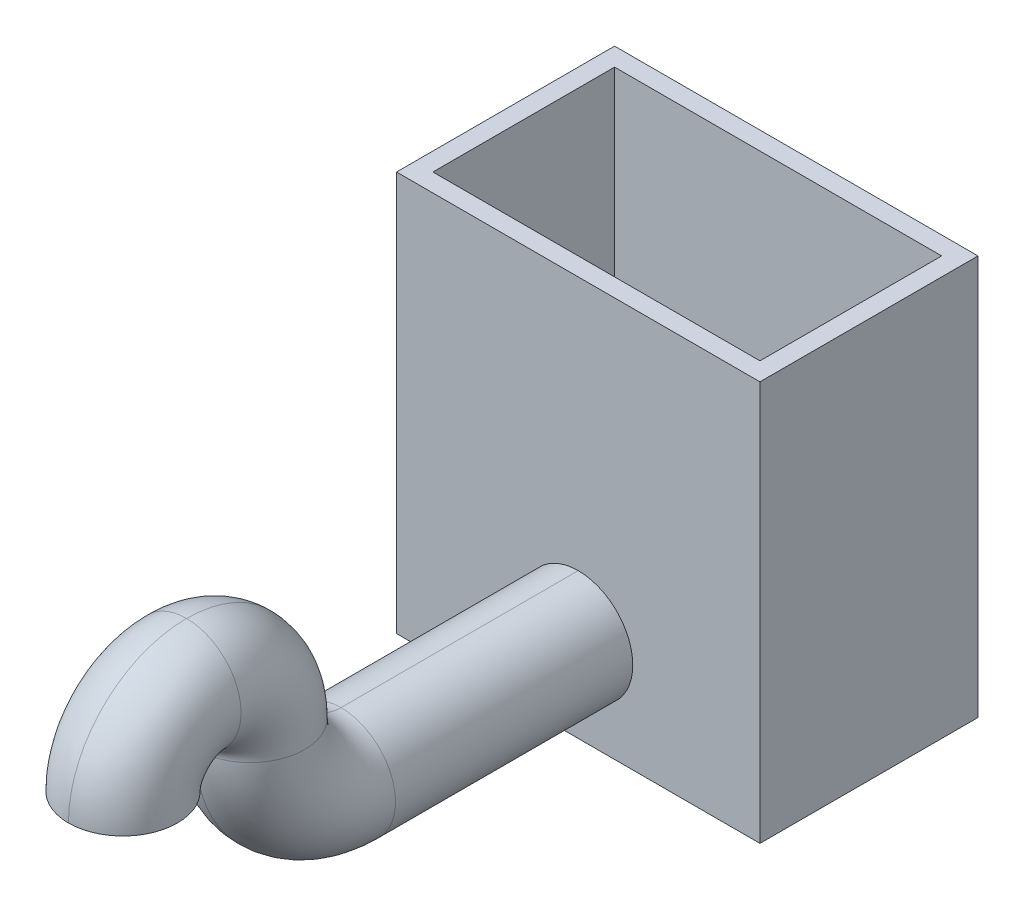
ISO-10303-21;
HEADER;
FILE_DESCRIPTION(('STEP AP214'),'2;1');
FILE_NAME('part.step','',(''),(''),'','','');
FILE_SCHEMA(('AUTOMOTIVE_DESIGN { 1 0 10303 214 1 1 1 1 }'));
ENDSEC;
DATA;
#1=APPLICATION_CONTEXT('core data for automotive mechanical design processes');
#2=APPLICATION_PROTOCOL_DEFINITION('international standard','automotive_design',2000,#1);
#3=PRODUCT_CONTEXT('',#1,'mechanical');
#4=PRODUCT('Part','Part','',(#3));
#5=PRODUCT_RELATED_PRODUCT_CATEGORY('part','',(#4));
#6=PRODUCT_DEFINITION_FORMATION('','',#4);
#7=PRODUCT_DEFINITION_CONTEXT('part definition',#1,'design');
#8=PRODUCT_DEFINITION('design','',#6,#7);
#9=PRODUCT_DEFINITION_SHAPE('','',#8);
#10=(LENGTH_UNIT() NAMED_UNIT(*) SI_UNIT(.MILLI.,.METRE.));
#11=(NAMED_UNIT(*) PLANE_ANGLE_UNIT() SI_UNIT($,.RADIAN.));
#12=(NAMED_UNIT(*) SI_UNIT($,.STERADIAN.) SOLID_ANGLE_UNIT());
#13=UNCERTAINTY_MEASURE_WITH_UNIT(LENGTH_MEASURE(1.E-05),#10,'distance_accuracy_value','');
#14=(GEOMETRIC_REPRESENTATION_CONTEXT(3) GLOBAL_UNCERTAINTY_ASSIGNED_CONTEXT((#13)) GLOBAL_UNIT_ASSIGNED_CONTEXT((#10,
#11,#12)) REPRESENTATION_CONTEXT('',''));
#15=CARTESIAN_POINT('',(0.,0.,0.));
#16=DIRECTION('',(0.,0.,1.));
#17=DIRECTION('',(1.,0.,0.));
#18=AXIS2_PLACEMENT_3D('',#15,#16,#17);
#19=CARTESIAN_POINT('',(100.,170.046296296297,250.573265730801));
#20=DIRECTION('',(-1.,0.,0.));
#21=DIRECTION('',(0.,-1.,0.));
#22=AXIS2_PLACEMENT_3D('',#19,#20,#21);
#23=TOROIDAL_SURFACE('',#22,50.,20.);
#24=CARTESIAN_POINT('',(100.,170.046296296297,250.573265730801));
#25=DIRECTION('',(-1.,0.,0.));
#26=DIRECTION('',(0.,-1.,0.));
#27=AXIS2_PLACEMENT_3D('',#24,#25,#26);
#28=CIRCLE('',#27,70.);
#29=CARTESIAN_POINT('',(100.,100.046296296296,250.573265730801));
#30=VERTEX_POINT('',#29);
#31=CARTESIAN_POINT('',(100.,170.046296296297,320.573265730801));
#32=VERTEX_POINT('',#31);
#33=EDGE_CURVE('E242',#30,#32,#28,.T.);
#34=ORIENTED_EDGE('',*,*,#33,.F.);
#35=CARTESIAN_POINT('',(100.,120.046296296296,250.573265730801));
#36=DIRECTION('',(0.,0.,1.));
#37=DIRECTION('',(-1.,0.,0.));
#38=AXIS2_PLACEMENT_3D('',#35,#36,#37);
#39=CIRCLE('',#38,20.);
#40=CARTESIAN_POINT('',(80.,120.046296296296,250.573265730801));
#41=VERTEX_POINT('',#40);
#42=EDGE_CURVE('E226',#41,#30,#39,.T.);
#43=ORIENTED_EDGE('',*,*,#42,.F.);
#44=CARTESIAN_POINT('',(100.,120.046296296296,250.573265730801));
#45=DIRECTION('',(0.,0.,1.));
#46=DIRECTION('',(-1.,0.,0.));
#47=AXIS2_PLACEMENT_3D('',#44,#45,#46);
#48=CIRCLE('',#47,20.);
#49=CARTESIAN_POINT('',(100.,140.046296296296,250.573265730801));
#50=VERTEX_POINT('',#49);
#51=EDGE_CURVE('E27',#50,#41,#48,.T.);
#52=ORIENTED_EDGE('',*,*,#51,.F.);
#53=CARTESIAN_POINT('',(100.,170.046296296297,250.573265730801));
#54=DIRECTION('',(-1.,0.,0.));
#55=DIRECTION('',(0.,-1.,0.));
#56=AXIS2_PLACEMENT_3D('',#53,#54,#55);
#57=CIRCLE('',#56,30.);
#58=CARTESIAN_POINT('',(100.,170.046296296297,280.573265730801));
#59=VERTEX_POINT('',#58);
#60=EDGE_CURVE('E234',#50,#59,#57,.T.);
#61=ORIENTED_EDGE('',*,*,#60,.T.);
#62=CARTESIAN_POINT('',(100.,170.046296296297,300.573265730801));
#63=DIRECTION('',(0.,1.,0.));
#64=DIRECTION('',(0.,0.,-1.));
#65=AXIS2_PLACEMENT_3D('',#62,#63,#64);
#66=CIRCLE('',#65,20.);
#67=EDGE_CURVE('E269',#59,#32,#66,.T.);
#68=ORIENTED_EDGE('',*,*,#67,.T.);
#69=EDGE_LOOP('',(#34,#43,#52,#61,#68));
#70=FACE_BOUND('',#69,.T.);
#71=ADVANCED_FACE('F16',(#70),#23,.F.);
#72=CARTESIAN_POINT('',(100.,170.046296296296,335.573265730801));
#73=DIRECTION('',(1.,0.,0.));
#74=DIRECTION('',(0.,1.,0.));
#75=AXIS2_PLACEMENT_3D('',#72,#73,#74);
#76=TOROIDAL_SURFACE('',#75,35.,20.);
#77=CARTESIAN_POINT('',(100.,170.046296296296,335.573265730801));
#78=DIRECTION('',(1.,0.,0.));
#79=DIRECTION('',(0.,1.,0.));
#80=AXIS2_PLACEMENT_3D('',#77,#78,#79);
#81=CIRCLE('',#80,55.);
#82=CARTESIAN_POINT('',(100.,225.046296296296,335.573265730801));
#83=VERTEX_POINT('',#82);
#84=EDGE_CURVE('E273',#59,#83,#81,.T.);
#85=ORIENTED_EDGE('',*,*,#84,.F.);
#86=CARTESIAN_POINT('',(100.,170.046296296297,300.573265730801));
#87=DIRECTION('',(0.,1.,0.));
#88=DIRECTION('',(0.,0.,-1.));
#89=AXIS2_PLACEMENT_3D('',#86,#87,#88);
#90=CIRCLE('',#89,20.);
#91=EDGE_CURVE('E250',#32,#59,#90,.T.);
#92=ORIENTED_EDGE('',*,*,#91,.F.);
#93=CARTESIAN_POINT('',(100.,170.046296296296,335.573265730801));
#94=DIRECTION('',(1.,0.,0.));
#95=DIRECTION('',(0.,1.,0.));
#96=AXIS2_PLACEMENT_3D('',#93,#94,#95);
#97=CIRCLE('',#96,15.);
#98=CARTESIAN_POINT('',(100.,185.046296296296,335.573265730801));
#99=VERTEX_POINT('',#98);
#100=EDGE_CURVE('E243',#32,#99,#97,.T.);
#101=ORIENTED_EDGE('',*,*,#100,.T.);
#102=CARTESIAN_POINT('',(100.,205.046296296296,335.573265730801));
#103=DIRECTION('',(0.,0.,-1.));
#104=DIRECTION('',(-1.,0.,0.));
#105=AXIS2_PLACEMENT_3D('',#102,#103,#104);
#106=CIRCLE('',#105,20.);
#107=EDGE_CURVE('E355',#83,#99,#106,.T.);
#108=ORIENTED_EDGE('',*,*,#107,.F.);
#109=EDGE_LOOP('',(#85,#92,#101,#108));
#110=FACE_BOUND('',#109,.T.);
#111=ADVANCED_FACE('F557',(#110),#76,.F.);
#112=CARTESIAN_POINT('',(100.,170.046296296297,370.573265730801));
#113=DIRECTION('',(0.,-1.,0.));
#114=DIRECTION('',(-1.,0.,0.));
#115=AXIS2_PLACEMENT_3D('',#112,#113,#114);
#116=PLANE('',#115);
#117=CARTESIAN_POINT('',(100.,170.046296296297,370.573265730801));
#118=DIRECTION('',(0.,-1.,0.));
#119=DIRECTION('',(0.,0.,-1.));
#120=AXIS2_PLACEMENT_3D('',#117,#118,#119);
#121=CIRCLE('',#120,20.);
#122=CARTESIAN_POINT('',(100.,170.046296296297,350.573265730801));
#123=VERTEX_POINT('',#122);
#124=CARTESIAN_POINT('',(100.,170.046296296297,390.573265730801));
#125=VERTEX_POINT('',#124);
#126=EDGE_CURVE('E61',#123,#125,#121,.T.);
#127=ORIENTED_EDGE('',*,*,#126,.F.);
#128=CARTESIAN_POINT('',(100.,170.046296296297,370.573265730801));
#129=DIRECTION('',(0.,-1.,0.));
#130=DIRECTION('',(0.,0.,-1.));
#131=AXIS2_PLACEMENT_3D('',#128,#129,#130);
#132=CIRCLE('',#131,20.);
#133=EDGE_CURVE('E366',#125,#123,#132,.T.);
#134=ORIENTED_EDGE('',*,*,#133,.F.);
#135=EDGE_LOOP('',(#127,#134));
#136=FACE_BOUND('',#135,.T.);
#137=CARTESIAN_POINT('',(100.,170.046296296297,370.573265730801));
#138=DIRECTION('',(0.,-1.,0.));
#139=DIRECTION('',(1.,0.,0.));
#140=AXIS2_PLACEMENT_3D('',#137,#138,#139);
#141=CIRCLE('',#140,30.);
#142=CARTESIAN_POINT('',(100.,170.046296296297,340.573265730801));
#143=VERTEX_POINT('',#142);
#144=CARTESIAN_POINT('',(100.,170.046296296297,400.573265730801));
#145=VERTEX_POINT('',#144);
#146=EDGE_CURVE('E263',#143,#145,#141,.T.);
#147=ORIENTED_EDGE('',*,*,#146,.T.);
#148=CARTESIAN_POINT('',(100.,170.046296296297,370.573265730801));
#149=DIRECTION('',(0.,-1.,0.));
#150=DIRECTION('',(1.,0.,0.));
#151=AXIS2_PLACEMENT_3D('',#148,#149,#150);
#152=CIRCLE('',#151,30.);
#153=EDGE_CURVE('E10',#145,#143,#152,.T.);
#154=ORIENTED_EDGE('',*,*,#153,.T.);
#155=EDGE_LOOP('',(#147,#154));
#156=FACE_BOUND('',#155,.T.);
#157=ADVANCED_FACE('F552',(#136,#156),#116,.T.);
#158=CARTESIAN_POINT('',(100.,120.046296296296,120.));
#159=DIRECTION('',(0.,0.,1.));
#160=DIRECTION('',(0.,-1.,0.));
#161=AXIS2_PLACEMENT_3D('',#158,#159,#160);
#162=CYLINDRICAL_SURFACE('',#161,30.);
#163=DIRECTION('',(0.,0.,1.));
#164=VECTOR('',#163,1.);
#165=CARTESIAN_POINT('',(100.,150.046296296297,120.));
#166=LINE('',#165,#164);
#167=CARTESIAN_POINT('',(100.,150.046296296297,120.));
#168=VERTEX_POINT('',#167);
#169=CARTESIAN_POINT('',(100.,150.046296296296,250.573265730801));
#170=VERTEX_POINT('',#169);
#171=EDGE_CURVE('E278',#168,#170,#166,.T.);
#172=ORIENTED_EDGE('',*,*,#171,.F.);
#173=CARTESIAN_POINT('',(100.,120.046296296296,120.));
#174=DIRECTION('',(0.,0.,1.));
#175=DIRECTION('',(1.,0.,0.));
#176=AXIS2_PLACEMENT_3D('',#173,#174,#175);
#177=CIRCLE('',#176,30.);
#178=CARTESIAN_POINT('',(100.,90.0462962962963,120.));
#179=VERTEX_POINT('',#178);
#180=EDGE_CURVE('E264',#168,#179,#177,.T.);
#181=ORIENTED_EDGE('',*,*,#180,.T.);
#182=DIRECTION('',(0.,0.,1.));
#183=VECTOR('',#182,1.);
#184=CARTESIAN_POINT('',(100.,90.0462962962963,120.));
#185=LINE('',#184,#183);
#186=CARTESIAN_POINT('',(100.,90.0462962962963,250.573265730801));
#187=VERTEX_POINT('',#186);
#188=EDGE_CURVE('E20',#179,#187,#185,.T.);
#189=ORIENTED_EDGE('',*,*,#188,.T.);
#190=CARTESIAN_POINT('',(100.,120.046296296296,250.573265730801));
#191=DIRECTION('',(0.,0.,1.));
#192=DIRECTION('',(1.,0.,0.));
#193=AXIS2_PLACEMENT_3D('',#190,#191,#192);
#194=CIRCLE('',#193,30.);
#195=EDGE_CURVE('E319',#170,#187,#194,.T.);
#196=ORIENTED_EDGE('',*,*,#195,.F.);
#197=EDGE_LOOP('',(#172,#181,#189,#196));
#198=FACE_BOUND('',#197,.T.);
#199=ADVANCED_FACE('F556',(#198),#162,.T.);
#200=CARTESIAN_POINT('',(100.,170.046296296297,250.573265730801));
#201=DIRECTION('',(-1.,0.,0.));
#202=DIRECTION('',(0.,-1.,0.));
#203=AXIS2_PLACEMENT_3D('',#200,#201,#202);
#204=TOROIDAL_SURFACE('',#203,50.,30.);
#205=CARTESIAN_POINT('',(100.,170.046296296297,250.573265730801));
#206=DIRECTION('',(-1.,0.,0.));
#207=DIRECTION('',(0.,-1.,0.));
#208=AXIS2_PLACEMENT_3D('',#205,#206,#207);
#209=CIRCLE('',#208,80.);
#210=CARTESIAN_POINT('',(100.,170.046296296297,330.573265730801));
#211=VERTEX_POINT('',#210);
#212=EDGE_CURVE('E315',#187,#211,#209,.T.);
#213=ORIENTED_EDGE('',*,*,#212,.F.);
#214=CARTESIAN_POINT('',(100.,120.046296296296,250.573265730801));
#215=DIRECTION('',(0.,0.,1.));
#216=DIRECTION('',(1.,0.,0.));
#217=AXIS2_PLACEMENT_3D('',#214,#215,#216);
#218=CIRCLE('',#217,30.);
#219=EDGE_CURVE('E274',#187,#170,#218,.T.);
#220=ORIENTED_EDGE('',*,*,#219,.T.);
#221=CARTESIAN_POINT('',(100.,170.046296296297,250.573265730801));
#222=DIRECTION('',(-1.,0.,0.));
#223=DIRECTION('',(0.,-1.,0.));
#224=AXIS2_PLACEMENT_3D('',#221,#222,#223);
#225=CIRCLE('',#224,20.);
#226=CARTESIAN_POINT('',(100.,170.046296296297,270.573265730801));
#227=VERTEX_POINT('',#226);
#228=EDGE_CURVE('E341',#170,#227,#225,.T.);
#229=ORIENTED_EDGE('',*,*,#228,.T.);
#230=CARTESIAN_POINT('',(100.,170.046296296297,300.573265730801));
#231=DIRECTION('',(0.,1.,0.));
#232=DIRECTION('',(1.,0.,0.));
#233=AXIS2_PLACEMENT_3D('',#230,#231,#232);
#234=CIRCLE('',#233,30.);
#235=EDGE_CURVE('E338',#211,#227,#234,.T.);
#236=ORIENTED_EDGE('',*,*,#235,.F.);
#237=EDGE_LOOP('',(#213,#220,#229,#236));
#238=FACE_BOUND('',#237,.T.);
#239=ADVANCED_FACE('F617',(#238),#204,.T.);
#240=CARTESIAN_POINT('',(100.,170.046296296296,335.573265730801));
#241=DIRECTION('',(1.,0.,0.));
#242=DIRECTION('',(0.,1.,0.));
#243=AXIS2_PLACEMENT_3D('',#240,#241,#242);
#244=TOROIDAL_SURFACE('',#243,35.,30.);
#245=CARTESIAN_POINT('',(100.,170.046296296296,335.573265730801));
#246=DIRECTION('',(1.,0.,0.));
#247=DIRECTION('',(0.,1.,0.));
#248=AXIS2_PLACEMENT_3D('',#245,#246,#247);
#249=CIRCLE('',#248,65.);
#250=CARTESIAN_POINT('',(100.,235.046296296296,335.573265730801));
#251=VERTEX_POINT('',#250);
#252=EDGE_CURVE('E260',#251,#145,#249,.T.);
#253=ORIENTED_EDGE('',*,*,#252,.F.);
#254=CARTESIAN_POINT('',(100.,205.046296296296,335.573265730801));
#255=DIRECTION('',(0.,0.,-1.));
#256=DIRECTION('',(-1.,0.,0.));
#257=AXIS2_PLACEMENT_3D('',#254,#255,#256);
#258=CIRCLE('',#257,30.);
#259=CARTESIAN_POINT('',(100.,175.046296296296,335.573265730801));
#260=VERTEX_POINT('',#259);
#261=EDGE_CURVE('E299',#260,#251,#258,.T.);
#262=ORIENTED_EDGE('',*,*,#261,.F.);
#263=CARTESIAN_POINT('',(100.,170.046296296296,335.573265730801));
#264=DIRECTION('',(1.,0.,0.));
#265=DIRECTION('',(0.,1.,0.));
#266=AXIS2_PLACEMENT_3D('',#263,#264,#265);
#267=CIRCLE('',#266,5.);
#268=EDGE_CURVE('E333',#260,#143,#267,.T.);
#269=ORIENTED_EDGE('',*,*,#268,.T.);
#270=ORIENTED_EDGE('',*,*,#153,.F.);
#271=EDGE_LOOP('',(#253,#262,#269,#270));
#272=FACE_BOUND('',#271,.T.);
#273=ADVANCED_FACE('F595',(#272),#244,.T.);
#274=CARTESIAN_POINT('',(100.,120.046296296296,110.));
#275=DIRECTION('',(0.,0.,1.));
#276=DIRECTION('',(1.,0.,0.));
#277=AXIS2_PLACEMENT_3D('',#274,#275,#276);
#278=CYLINDRICAL_SURFACE('',#277,20.);
#279=DIRECTION('',(0.,0.,1.));
#280=VECTOR('',#279,1.);
#281=CARTESIAN_POINT('',(80.,120.046296296296,110.));
#282=LINE('',#281,#280);
#283=CARTESIAN_POINT('',(80.,120.046296296296,110.));
#284=VERTEX_POINT('',#283);
#285=EDGE_CURVE('E910',#284,#41,#282,.T.);
#286=ORIENTED_EDGE('',*,*,#285,.F.);
#287=CARTESIAN_POINT('',(100.,120.046296296296,110.));
#288=DIRECTION('',(0.,0.,1.));
#289=DIRECTION('',(1.,0.,0.));
#290=AXIS2_PLACEMENT_3D('',#287,#288,#289);
#291=CIRCLE('',#290,20.);
#292=CARTESIAN_POINT('',(120.,120.046296296296,110.));
#293=VERTEX_POINT('',#292);
#294=EDGE_CURVE('E219',#293,#284,#291,.T.);
#295=ORIENTED_EDGE('',*,*,#294,.F.);
#296=DIRECTION('',(0.,0.,1.));
#297=VECTOR('',#296,1.);
#298=CARTESIAN_POINT('',(120.,120.046296296296,110.));
#299=LINE('',#298,#297);
#300=CARTESIAN_POINT('',(120.,120.046296296296,250.573265730801));
#301=VERTEX_POINT('',#300);
#302=EDGE_CURVE('E213',#293,#301,#299,.T.);
#303=ORIENTED_EDGE('',*,*,#302,.T.);
#304=CARTESIAN_POINT('',(100.,120.046296296296,250.573265730801));
#305=DIRECTION('',(0.,0.,1.));
#306=DIRECTION('',(-1.,0.,0.));
#307=AXIS2_PLACEMENT_3D('',#304,#305,#306);
#308=CIRCLE('',#307,20.);
#309=EDGE_CURVE('E217',#301,#50,#308,.T.);
#310=ORIENTED_EDGE('',*,*,#309,.T.);
#311=ORIENTED_EDGE('',*,*,#51,.T.);
#312=EDGE_LOOP('',(#286,#295,#303,#310,#311));
#313=FACE_BOUND('',#312,.T.);
#314=ADVANCED_FACE('F216',(#313),#278,.F.);
#315=CARTESIAN_POINT('',(190.,106.464052017137,69.575962429987));
#316=DIRECTION('',(0.,0.837096174229633,0.547055751354569));
#317=DIRECTION('',(1.,0.,0.));
#318=AXIS2_PLACEMENT_3D('',#315,#316,#317);
#319=PLANE('',#318);
#320=DIRECTION('',(0.,0.547055751354569,-0.837096174229633));
#321=VECTOR('',#320,1.);
#322=CARTESIAN_POINT('',(10.,106.464052017137,69.5759624299871));
#323=LINE('',#322,#321);
#324=CARTESIAN_POINT('',(10.,80.0462962962963,110.));
#325=VERTEX_POINT('',#324);
#326=CARTESIAN_POINT('',(10.,145.39789724681,10.));
#327=VERTEX_POINT('',#326);
#328=EDGE_CURVE('E283',#325,#327,#323,.T.);
#329=ORIENTED_EDGE('',*,*,#328,.F.);
#330=DIRECTION('',(1.,0.,0.));
#331=VECTOR('',#330,1.);
#332=CARTESIAN_POINT('',(10.,80.0462962962963,110.));
#333=LINE('',#332,#331);
#334=CARTESIAN_POINT('',(190.,80.0462962962963,110.));
#335=VERTEX_POINT('',#334);
#336=EDGE_CURVE('E42',#325,#335,#333,.T.);
#337=ORIENTED_EDGE('',*,*,#336,.T.);
#338=DIRECTION('',(0.,0.547055751354569,-0.837096174229633));
#339=VECTOR('',#338,1.);
#340=CARTESIAN_POINT('',(190.,106.464052017137,69.575962429987));
#341=LINE('',#340,#339);
#342=CARTESIAN_POINT('',(190.,145.39789724681,10.));
#343=VERTEX_POINT('',#342);
#344=EDGE_CURVE('E324',#335,#343,#341,.T.);
#345=ORIENTED_EDGE('',*,*,#344,.T.);
#346=DIRECTION('',(-1.,0.,0.));
#347=VECTOR('',#346,1.);
#348=CARTESIAN_POINT('',(190.,145.39789724681,10.));
#349=LINE('',#348,#347);
#350=EDGE_CURVE('E282',#343,#327,#349,.T.);
#351=ORIENTED_EDGE('',*,*,#350,.T.);
#352=EDGE_LOOP('',(#329,#337,#345,#351));
#353=FACE_BOUND('',#352,.T.);
#354=ADVANCED_FACE('F594',(#353),#319,.T.);
#355=CARTESIAN_POINT('',(10.,80.0462962962963,110.));
#356=DIRECTION('',(0.,0.,1.));
#357=DIRECTION('',(1.,0.,0.));
#358=AXIS2_PLACEMENT_3D('',#355,#356,#357);
#359=PLANE('',#358);
#360=ORIENTED_EDGE('',*,*,#294,.T.);
#361=CARTESIAN_POINT('',(100.,120.046296296296,110.));
#362=DIRECTION('',(0.,0.,1.));
#363=DIRECTION('',(1.,0.,0.));
#364=AXIS2_PLACEMENT_3D('',#361,#362,#363);
#365=CIRCLE('',#364,20.);
#366=EDGE_CURVE('E517',#284,#293,#365,.T.);
#367=ORIENTED_EDGE('',*,*,#366,.T.);
#368=EDGE_LOOP('',(#360,#367));
#369=FACE_BOUND('',#368,.T.);
#370=DIRECTION('',(1.,0.,0.));
#371=VECTOR('',#370,1.);
#372=CARTESIAN_POINT('',(10.,290.046296296296,110.));
#373=LINE('',#372,#371);
#374=CARTESIAN_POINT('',(10.,290.046296296296,110.));
#375=VERTEX_POINT('',#374);
#376=CARTESIAN_POINT('',(190.,290.046296296296,110.));
#377=VERTEX_POINT('',#376);
#378=EDGE_CURVE('E369',#375,#377,#373,.T.);
#379=ORIENTED_EDGE('',*,*,#378,.T.);
#380=DIRECTION('',(0.,1.,0.));
#381=VECTOR('',#380,1.);
#382=CARTESIAN_POINT('',(190.,80.0462962962963,110.));
#383=LINE('',#382,#381);
#384=EDGE_CURVE('E391',#335,#377,#383,.T.);
#385=ORIENTED_EDGE('',*,*,#384,.F.);
#386=ORIENTED_EDGE('',*,*,#336,.F.);
#387=DIRECTION('',(0.,1.,0.));
#388=VECTOR('',#387,1.);
#389=CARTESIAN_POINT('',(10.,80.0462962962963,110.));
#390=LINE('',#389,#388);
#391=EDGE_CURVE('E267',#325,#375,#390,.T.);
#392=ORIENTED_EDGE('',*,*,#391,.T.);
#393=EDGE_LOOP('',(#379,#385,#386,#392));
#394=FACE_BOUND('',#393,.T.);
#395=ADVANCED_FACE('F634',(#369,#394),#359,.F.);
#396=CARTESIAN_POINT('',(190.,80.0462962962963,10.));
#397=DIRECTION('',(1.,0.,0.));
#398=DIRECTION('',(0.,1.,0.));
#399=AXIS2_PLACEMENT_3D('',#396,#397,#398);
#400=PLANE('',#399);
#401=DIRECTION('',(0.,1.,0.));
#402=VECTOR('',#401,1.);
#403=CARTESIAN_POINT('',(190.,80.0462962962963,10.));
#404=LINE('',#403,#402);
#405=CARTESIAN_POINT('',(190.,290.046296296296,10.));
#406=VERTEX_POINT('',#405);
#407=EDGE_CURVE('E321',#343,#406,#404,.T.);
#408=ORIENTED_EDGE('',*,*,#407,.F.);
#409=ORIENTED_EDGE('',*,*,#344,.F.);
#410=ORIENTED_EDGE('',*,*,#384,.T.);
#411=DIRECTION('',(0.,0.,-1.));
#412=VECTOR('',#411,1.);
#413=CARTESIAN_POINT('',(190.,290.046296296296,10.));
#414=LINE('',#413,#412);
#415=EDGE_CURVE('E268',#377,#406,#414,.T.);
#416=ORIENTED_EDGE('',*,*,#415,.T.);
#417=EDGE_LOOP('',(#408,#409,#410,#416));
#418=FACE_BOUND('',#417,.T.);
#419=ADVANCED_FACE('F525',(#418),#400,.F.);
#420=CARTESIAN_POINT('',(10.,80.0462962962963,10.));
#421=DIRECTION('',(0.,0.,-1.));
#422=DIRECTION('',(0.,-1.,0.));
#423=AXIS2_PLACEMENT_3D('',#420,#421,#422);
#424=PLANE('',#423);
#425=DIRECTION('',(0.,1.,0.));
#426=VECTOR('',#425,1.);
#427=CARTESIAN_POINT('',(10.,80.0462962962963,10.));
#428=LINE('',#427,#426);
#429=CARTESIAN_POINT('',(10.,290.046296296296,10.));
#430=VERTEX_POINT('',#429);
#431=EDGE_CURVE('E279',#327,#430,#428,.T.);
#432=ORIENTED_EDGE('',*,*,#431,.F.);
#433=ORIENTED_EDGE('',*,*,#350,.F.);
#434=ORIENTED_EDGE('',*,*,#407,.T.);
#435=DIRECTION('',(-1.,0.,0.));
#436=VECTOR('',#435,1.);
#437=CARTESIAN_POINT('',(10.,290.046296296296,10.));
#438=LINE('',#437,#436);
#439=EDGE_CURVE('E328',#406,#430,#438,.T.);
#440=ORIENTED_EDGE('',*,*,#439,.T.);
#441=EDGE_LOOP('',(#432,#433,#434,#440));
#442=FACE_BOUND('',#441,.T.);
#443=ADVANCED_FACE('F520',(#442),#424,.F.);
#444=CARTESIAN_POINT('',(10.,80.0462962962963,10.));
#445=DIRECTION('',(-1.,0.,0.));
#446=DIRECTION('',(0.,1.,0.));
#447=AXIS2_PLACEMENT_3D('',#444,#445,#446);
#448=PLANE('',#447);
#449=ORIENTED_EDGE('',*,*,#391,.F.);
#450=ORIENTED_EDGE('',*,*,#328,.T.);
#451=ORIENTED_EDGE('',*,*,#431,.T.);
#452=DIRECTION('',(0.,0.,1.));
#453=VECTOR('',#452,1.);
#454=CARTESIAN_POINT('',(10.,290.046296296296,10.));
#455=LINE('',#454,#453);
#456=EDGE_CURVE('E373',#430,#375,#455,.T.);
#457=ORIENTED_EDGE('',*,*,#456,.T.);
#458=EDGE_LOOP('',(#449,#450,#451,#457));
#459=FACE_BOUND('',#458,.T.);
#460=ADVANCED_FACE('F524',(#459),#448,.F.);
#461=CARTESIAN_POINT('',(0.,0.,0.));
#462=DIRECTION('',(0.,0.,1.));
#463=DIRECTION('',(1.,0.,0.));
#464=AXIS2_PLACEMENT_3D('',#461,#462,#463);
#465=PLANE('',#464);
#466=DIRECTION('',(0.,-1.,0.));
#467=VECTOR('',#466,1.);
#468=CARTESIAN_POINT('',(0.,290.046296296296,0.));
#469=LINE('',#468,#467);
#470=CARTESIAN_POINT('',(0.,290.046296296296,0.));
#471=VERTEX_POINT('',#470);
#472=CARTESIAN_POINT('',(0.,70.0462962962963,0.));
#473=VERTEX_POINT('',#472);
#474=EDGE_CURVE('E225',#471,#473,#469,.T.);
#475=ORIENTED_EDGE('',*,*,#474,.F.);
#476=DIRECTION('',(-1.,0.,0.));
#477=VECTOR('',#476,1.);
#478=CARTESIAN_POINT('',(0.,290.046296296296,0.));
#479=LINE('',#478,#477);
#480=CARTESIAN_POINT('',(200.,290.046296296296,0.));
#481=VERTEX_POINT('',#480);
#482=EDGE_CURVE('E370',#481,#471,#479,.T.);
#483=ORIENTED_EDGE('',*,*,#482,.F.);
#484=DIRECTION('',(0.,1.,0.));
#485=VECTOR('',#484,1.);
#486=CARTESIAN_POINT('',(200.,290.046296296296,0.));
#487=LINE('',#486,#485);
#488=CARTESIAN_POINT('',(200.,70.0462962962963,0.));
#489=VERTEX_POINT('',#488);
#490=EDGE_CURVE('E94',#489,#481,#487,.T.);
#491=ORIENTED_EDGE('',*,*,#490,.F.);
#492=DIRECTION('',(1.,0.,0.));
#493=VECTOR('',#492,1.);
#494=CARTESIAN_POINT('',(0.,70.0462962962963,0.));
#495=LINE('',#494,#493);
#496=EDGE_CURVE('E309',#473,#489,#495,.T.);
#497=ORIENTED_EDGE('',*,*,#496,.F.);
#498=EDGE_LOOP('',(#475,#483,#491,#497));
#499=FACE_BOUND('',#498,.T.);
#500=ADVANCED_FACE('F585',(#499),#465,.F.);
#501=CARTESIAN_POINT('',(0.,0.,120.));
#502=DIRECTION('',(0.,0.,1.));
#503=DIRECTION('',(1.,0.,0.));
#504=AXIS2_PLACEMENT_3D('',#501,#502,#503);
#505=PLANE('',#504);
#506=CARTESIAN_POINT('',(100.,120.046296296296,120.));
#507=DIRECTION('',(0.,0.,1.));
#508=DIRECTION('',(1.,0.,0.));
#509=AXIS2_PLACEMENT_3D('',#506,#507,#508);
#510=CIRCLE('',#509,30.);
#511=EDGE_CURVE('E292',#179,#168,#510,.T.);
#512=ORIENTED_EDGE('',*,*,#511,.F.);
#513=ORIENTED_EDGE('',*,*,#180,.F.);
#514=EDGE_LOOP('',(#512,#513));
#515=FACE_BOUND('',#514,.T.);
#516=DIRECTION('',(0.,-1.,0.));
#517=VECTOR('',#516,1.);
#518=CARTESIAN_POINT('',(0.,290.046296296296,120.));
#519=LINE('',#518,#517);
#520=CARTESIAN_POINT('',(0.,290.046296296296,120.));
#521=VERTEX_POINT('',#520);
#522=CARTESIAN_POINT('',(0.,70.0462962962963,120.));
#523=VERTEX_POINT('',#522);
#524=EDGE_CURVE('E288',#521,#523,#519,.T.);
#525=ORIENTED_EDGE('',*,*,#524,.T.);
#526=DIRECTION('',(1.,0.,0.));
#527=VECTOR('',#526,1.);
#528=CARTESIAN_POINT('',(0.,70.0462962962963,120.));
#529=LINE('',#528,#527);
#530=CARTESIAN_POINT('',(200.,70.0462962962963,120.));
#531=VERTEX_POINT('',#530);
#532=EDGE_CURVE('E258',#523,#531,#529,.T.);
#533=ORIENTED_EDGE('',*,*,#532,.T.);
#534=DIRECTION('',(0.,1.,0.));
#535=VECTOR('',#534,1.);
#536=CARTESIAN_POINT('',(200.,290.046296296296,120.));
#537=LINE('',#536,#535);
#538=CARTESIAN_POINT('',(200.,290.046296296296,120.));
#539=VERTEX_POINT('',#538);
#540=EDGE_CURVE('E304',#531,#539,#537,.T.);
#541=ORIENTED_EDGE('',*,*,#540,.T.);
#542=DIRECTION('',(-1.,0.,0.));
#543=VECTOR('',#542,1.);
#544=CARTESIAN_POINT('',(0.,290.046296296296,120.));
#545=LINE('',#544,#543);
#546=EDGE_CURVE('E111',#539,#521,#545,.T.);
#547=ORIENTED_EDGE('',*,*,#546,.T.);
#548=EDGE_LOOP('',(#525,#533,#541,#547));
#549=FACE_BOUND('',#548,.T.);
#550=ADVANCED_FACE('F580',(#515,#549),#505,.T.);
#551=CARTESIAN_POINT('',(0.,290.046296296296,120.));
#552=DIRECTION('',(0.,-1.,0.));
#553=DIRECTION('',(0.,0.,-1.));
#554=AXIS2_PLACEMENT_3D('',#551,#552,#553);
#555=PLANE('',#554);
#556=ORIENTED_EDGE('',*,*,#378,.F.);
#557=ORIENTED_EDGE('',*,*,#456,.F.);
#558=ORIENTED_EDGE('',*,*,#439,.F.);
#559=ORIENTED_EDGE('',*,*,#415,.F.);
#560=EDGE_LOOP('',(#556,#557,#558,#559));
#561=FACE_BOUND('',#560,.T.);
#562=ORIENTED_EDGE('',*,*,#482,.T.);
#563=DIRECTION('',(0.,0.,-1.));
#564=VECTOR('',#563,1.);
#565=CARTESIAN_POINT('',(0.,290.046296296296,120.));
#566=LINE('',#565,#564);
#567=EDGE_CURVE('E305',#521,#471,#566,.T.);
#568=ORIENTED_EDGE('',*,*,#567,.F.);
#569=ORIENTED_EDGE('',*,*,#546,.F.);
#570=DIRECTION('',(0.,0.,-1.));
#571=VECTOR('',#570,1.);
#572=CARTESIAN_POINT('',(200.,290.046296296296,120.));
#573=LINE('',#572,#571);
#574=EDGE_CURVE('E300',#539,#481,#573,.T.);
#575=ORIENTED_EDGE('',*,*,#574,.T.);
#576=EDGE_LOOP('',(#562,#568,#569,#575));
#577=FACE_BOUND('',#576,.T.);
#578=ADVANCED_FACE('F584',(#561,#577),#555,.F.);
#579=CARTESIAN_POINT('',(200.,290.046296296296,120.));
#580=DIRECTION('',(-1.,0.,0.));
#581=DIRECTION('',(0.,1.,0.));
#582=AXIS2_PLACEMENT_3D('',#579,#580,#581);
#583=PLANE('',#582);
#584=ORIENTED_EDGE('',*,*,#490,.T.);
#585=ORIENTED_EDGE('',*,*,#574,.F.);
#586=ORIENTED_EDGE('',*,*,#540,.F.);
#587=DIRECTION('',(0.,0.,-1.));
#588=VECTOR('',#587,1.);
#589=CARTESIAN_POINT('',(200.,70.0462962962963,120.));
#590=LINE('',#589,#588);
#591=EDGE_CURVE('E310',#531,#489,#590,.T.);
#592=ORIENTED_EDGE('',*,*,#591,.T.);
#593=EDGE_LOOP('',(#584,#585,#586,#592));
#594=FACE_BOUND('',#593,.T.);
#595=ADVANCED_FACE('F661',(#594),#583,.F.);
#596=CARTESIAN_POINT('',(0.,70.0462962962963,120.));
#597=DIRECTION('',(0.,1.,0.));
#598=DIRECTION('',(1.,0.,0.));
#599=AXIS2_PLACEMENT_3D('',#596,#597,#598);
#600=PLANE('',#599);
#601=ORIENTED_EDGE('',*,*,#496,.T.);
#602=ORIENTED_EDGE('',*,*,#591,.F.);
#603=ORIENTED_EDGE('',*,*,#532,.F.);
#604=DIRECTION('',(0.,0.,-1.));
#605=VECTOR('',#604,1.);
#606=CARTESIAN_POINT('',(0.,70.0462962962963,120.));
#607=LINE('',#606,#605);
#608=EDGE_CURVE('E284',#523,#473,#607,.T.);
#609=ORIENTED_EDGE('',*,*,#608,.T.);
#610=EDGE_LOOP('',(#601,#602,#603,#609));
#611=FACE_BOUND('',#610,.T.);
#612=ADVANCED_FACE('F546',(#611),#600,.F.);
#613=CARTESIAN_POINT('',(0.,290.046296296296,120.));
#614=DIRECTION('',(1.,0.,0.));
#615=DIRECTION('',(0.,1.,0.));
#616=AXIS2_PLACEMENT_3D('',#613,#614,#615);
#617=PLANE('',#616);
#618=ORIENTED_EDGE('',*,*,#474,.T.);
#619=ORIENTED_EDGE('',*,*,#608,.F.);
#620=ORIENTED_EDGE('',*,*,#524,.F.);
#621=ORIENTED_EDGE('',*,*,#567,.T.);
#622=EDGE_LOOP('',(#618,#619,#620,#621));
#623=FACE_BOUND('',#622,.T.);
#624=ADVANCED_FACE('F542',(#623),#617,.F.);
#625=CARTESIAN_POINT('',(100.,120.046296296296,110.));
#626=DIRECTION('',(0.,0.,1.));
#627=DIRECTION('',(1.,0.,0.));
#628=AXIS2_PLACEMENT_3D('',#625,#626,#627);
#629=CYLINDRICAL_SURFACE('',#628,20.);
#630=ORIENTED_EDGE('',*,*,#366,.F.);
#631=ORIENTED_EDGE('',*,*,#285,.T.);
#632=ORIENTED_EDGE('',*,*,#42,.T.);
#633=CARTESIAN_POINT('',(100.,120.046296296296,250.573265730801));
#634=DIRECTION('',(0.,0.,1.));
#635=DIRECTION('',(-1.,0.,0.));
#636=AXIS2_PLACEMENT_3D('',#633,#634,#635);
#637=CIRCLE('',#636,20.);
#638=EDGE_CURVE('E232',#30,#301,#637,.T.);
#639=ORIENTED_EDGE('',*,*,#638,.T.);
#640=ORIENTED_EDGE('',*,*,#302,.F.);
#641=EDGE_LOOP('',(#630,#631,#632,#639,#640));
#642=FACE_BOUND('',#641,.T.);
#643=ADVANCED_FACE('F18',(#642),#629,.F.);
#644=CARTESIAN_POINT('',(100.,120.046296296296,120.));
#645=DIRECTION('',(0.,0.,1.));
#646=DIRECTION('',(0.,-1.,0.));
#647=AXIS2_PLACEMENT_3D('',#644,#645,#646);
#648=CYLINDRICAL_SURFACE('',#647,30.);
#649=ORIENTED_EDGE('',*,*,#511,.T.);
#650=ORIENTED_EDGE('',*,*,#171,.T.);
#651=ORIENTED_EDGE('',*,*,#219,.F.);
#652=ORIENTED_EDGE('',*,*,#188,.F.);
#653=EDGE_LOOP('',(#649,#650,#651,#652));
#654=FACE_BOUND('',#653,.T.);
#655=ADVANCED_FACE('F570',(#654),#648,.T.);
#656=CARTESIAN_POINT('',(100.,170.046296296296,335.573265730801));
#657=DIRECTION('',(1.,0.,0.));
#658=DIRECTION('',(0.,1.,0.));
#659=AXIS2_PLACEMENT_3D('',#656,#657,#658);
#660=TOROIDAL_SURFACE('',#659,35.,30.);
#661=CARTESIAN_POINT('',(100.,170.046296296296,335.573265730801));
#662=DIRECTION('',(1.,0.,0.));
#663=DIRECTION('',(0.,1.,0.));
#664=AXIS2_PLACEMENT_3D('',#661,#662,#663);
#665=CIRCLE('',#664,65.);
#666=EDGE_CURVE('E77',#227,#251,#665,.T.);
#667=ORIENTED_EDGE('',*,*,#666,.F.);
#668=CARTESIAN_POINT('',(100.,170.046296296297,300.573265730801));
#669=DIRECTION('',(0.,1.,0.));
#670=DIRECTION('',(1.,0.,0.));
#671=AXIS2_PLACEMENT_3D('',#668,#669,#670);
#672=CIRCLE('',#671,30.);
#673=EDGE_CURVE('E318',#227,#211,#672,.T.);
#674=ORIENTED_EDGE('',*,*,#673,.T.);
#675=CARTESIAN_POINT('',(100.,170.046296296296,335.573265730801));
#676=DIRECTION('',(1.,0.,0.));
#677=DIRECTION('',(0.,1.,0.));
#678=AXIS2_PLACEMENT_3D('',#675,#676,#677);
#679=CIRCLE('',#678,5.);
#680=EDGE_CURVE('E349',#211,#260,#679,.T.);
#681=ORIENTED_EDGE('',*,*,#680,.T.);
#682=ORIENTED_EDGE('',*,*,#261,.T.);
#683=EDGE_LOOP('',(#667,#674,#681,#682));
#684=FACE_BOUND('',#683,.T.);
#685=ADVANCED_FACE('F574',(#684),#660,.T.);
#686=CARTESIAN_POINT('',(100.,170.046296296296,335.573265730801));
#687=DIRECTION('',(1.,0.,0.));
#688=DIRECTION('',(0.,1.,0.));
#689=AXIS2_PLACEMENT_3D('',#686,#687,#688);
#690=TOROIDAL_SURFACE('',#689,35.,20.);
#691=CARTESIAN_POINT('',(100.,170.046296296296,335.573265730801));
#692=DIRECTION('',(1.,0.,0.));
#693=DIRECTION('',(0.,1.,0.));
#694=AXIS2_PLACEMENT_3D('',#691,#692,#693);
#695=CIRCLE('',#694,55.);
#696=EDGE_CURVE('E362',#83,#125,#695,.T.);
#697=ORIENTED_EDGE('',*,*,#696,.F.);
#698=ORIENTED_EDGE('',*,*,#107,.T.);
#699=CARTESIAN_POINT('',(100.,170.046296296296,335.573265730801));
#700=DIRECTION('',(1.,0.,0.));
#701=DIRECTION('',(0.,1.,0.));
#702=AXIS2_PLACEMENT_3D('',#699,#700,#701);
#703=CIRCLE('',#702,15.);
#704=EDGE_CURVE('E357',#99,#123,#703,.T.);
#705=ORIENTED_EDGE('',*,*,#704,.T.);
#706=ORIENTED_EDGE('',*,*,#126,.T.);
#707=EDGE_LOOP('',(#697,#698,#705,#706));
#708=FACE_BOUND('',#707,.T.);
#709=ADVANCED_FACE('F536',(#708),#690,.F.);
#710=CARTESIAN_POINT('',(100.,170.046296296296,335.573265730801));
#711=DIRECTION('',(1.,0.,0.));
#712=DIRECTION('',(0.,1.,0.));
#713=AXIS2_PLACEMENT_3D('',#710,#711,#712);
#714=TOROIDAL_SURFACE('',#713,35.,20.);
#715=CARTESIAN_POINT('',(100.,205.046296296296,335.573265730801));
#716=DIRECTION('',(0.,0.,-1.));
#717=DIRECTION('',(-1.,0.,0.));
#718=AXIS2_PLACEMENT_3D('',#715,#716,#717);
#719=CIRCLE('',#718,20.);
#720=EDGE_CURVE('E254',#99,#83,#719,.T.);
#721=ORIENTED_EDGE('',*,*,#720,.T.);
#722=ORIENTED_EDGE('',*,*,#696,.T.);
#723=ORIENTED_EDGE('',*,*,#133,.T.);
#724=ORIENTED_EDGE('',*,*,#704,.F.);
#725=EDGE_LOOP('',(#721,#722,#723,#724));
#726=FACE_BOUND('',#725,.T.);
#727=ADVANCED_FACE('F531',(#726),#714,.F.);
#728=CARTESIAN_POINT('',(100.,170.046296296296,335.573265730801));
#729=DIRECTION('',(1.,0.,0.));
#730=DIRECTION('',(0.,1.,0.));
#731=AXIS2_PLACEMENT_3D('',#728,#729,#730);
#732=TOROIDAL_SURFACE('',#731,35.,30.);
#733=ORIENTED_EDGE('',*,*,#235,.T.);
#734=ORIENTED_EDGE('',*,*,#666,.T.);
#735=CARTESIAN_POINT('',(100.,205.046296296296,335.573265730801));
#736=DIRECTION('',(0.,0.,-1.));
#737=DIRECTION('',(-1.,0.,0.));
#738=AXIS2_PLACEMENT_3D('',#735,#736,#737);
#739=CIRCLE('',#738,30.);
#740=EDGE_CURVE('E236',#251,#260,#739,.T.);
#741=ORIENTED_EDGE('',*,*,#740,.T.);
#742=ORIENTED_EDGE('',*,*,#680,.F.);
#743=EDGE_LOOP('',(#733,#734,#741,#742));
#744=FACE_BOUND('',#743,.T.);
#745=ADVANCED_FACE('F535',(#744),#732,.T.);
#746=CARTESIAN_POINT('',(100.,170.046296296297,250.573265730801));
#747=DIRECTION('',(-1.,0.,0.));
#748=DIRECTION('',(0.,-1.,0.));
#749=AXIS2_PLACEMENT_3D('',#746,#747,#748);
#750=TOROIDAL_SURFACE('',#749,50.,30.);
#751=ORIENTED_EDGE('',*,*,#195,.T.);
#752=ORIENTED_EDGE('',*,*,#212,.T.);
#753=ORIENTED_EDGE('',*,*,#673,.F.);
#754=ORIENTED_EDGE('',*,*,#228,.F.);
#755=EDGE_LOOP('',(#751,#752,#753,#754));
#756=FACE_BOUND('',#755,.T.);
#757=ADVANCED_FACE('F604',(#756),#750,.T.);
#758=CARTESIAN_POINT('',(100.,170.046296296296,335.573265730801));
#759=DIRECTION('',(1.,0.,0.));
#760=DIRECTION('',(0.,1.,0.));
#761=AXIS2_PLACEMENT_3D('',#758,#759,#760);
#762=TOROIDAL_SURFACE('',#761,35.,30.);
#763=ORIENTED_EDGE('',*,*,#740,.F.);
#764=ORIENTED_EDGE('',*,*,#252,.T.);
#765=ORIENTED_EDGE('',*,*,#146,.F.);
#766=ORIENTED_EDGE('',*,*,#268,.F.);
#767=EDGE_LOOP('',(#763,#764,#765,#766));
#768=FACE_BOUND('',#767,.T.);
#769=ADVANCED_FACE('F600',(#768),#762,.T.);
#770=CARTESIAN_POINT('',(100.,170.046296296297,250.573265730801));
#771=DIRECTION('',(-1.,0.,0.));
#772=DIRECTION('',(0.,-1.,0.));
#773=AXIS2_PLACEMENT_3D('',#770,#771,#772);
#774=TOROIDAL_SURFACE('',#773,50.,20.);
#775=ORIENTED_EDGE('',*,*,#638,.F.);
#776=ORIENTED_EDGE('',*,*,#33,.T.);
#777=ORIENTED_EDGE('',*,*,#91,.T.);
#778=ORIENTED_EDGE('',*,*,#60,.F.);
#779=ORIENTED_EDGE('',*,*,#309,.F.);
#780=EDGE_LOOP('',(#775,#776,#777,#778,#779));
#781=FACE_BOUND('',#780,.T.);
#782=ADVANCED_FACE('F230',(#781),#774,.F.);
#783=CARTESIAN_POINT('',(100.,170.046296296296,335.573265730801));
#784=DIRECTION('',(1.,0.,0.));
#785=DIRECTION('',(0.,1.,0.));
#786=AXIS2_PLACEMENT_3D('',#783,#784,#785);
#787=TOROIDAL_SURFACE('',#786,35.,20.);
#788=ORIENTED_EDGE('',*,*,#67,.F.);
#789=ORIENTED_EDGE('',*,*,#84,.T.);
#790=ORIENTED_EDGE('',*,*,#720,.F.);
#791=ORIENTED_EDGE('',*,*,#100,.F.);
#792=EDGE_LOOP('',(#788,#789,#790,#791));
#793=FACE_BOUND('',#792,.T.);
#794=ADVANCED_FACE('F670',(#793),#787,.F.);
#795=CLOSED_SHELL('',(#71,#111,#157,#199,#239,#273,#314,#354,#395,#419,#443,#460,#500,#550,#578,
#595,#612,#624,#643,#655,#685,#709,#727,#745,#757,#769,#782,#794));
#796=MANIFOLD_SOLID_BREP('B1',#795);
#797=ADVANCED_BREP_SHAPE_REPRESENTATION('',(#18,#796),#14);
#798=SHAPE_DEFINITION_REPRESENTATION(#9,#797);
ENDSEC;
END-ISO-10303-21;
